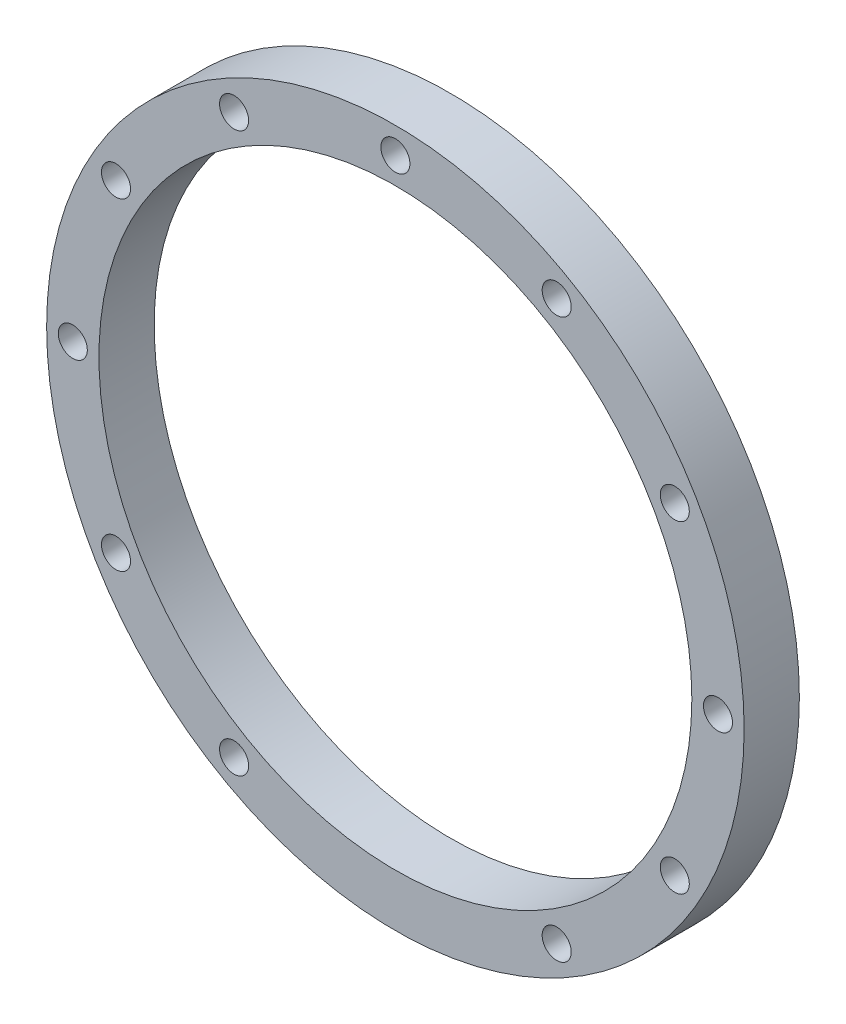
ISO-10303-21;
HEADER;
FILE_DESCRIPTION(('STEP AP214'),'2;1');
FILE_NAME('part.step','',(''),(''),'','','');
FILE_SCHEMA(('AUTOMOTIVE_DESIGN { 1 0 10303 214 1 1 1 1 }'));
ENDSEC;
DATA;
#1=APPLICATION_CONTEXT('core data for automotive mechanical design processes');
#2=APPLICATION_PROTOCOL_DEFINITION('international standard','automotive_design',2000,#1);
#3=PRODUCT_CONTEXT('',#1,'mechanical');
#4=PRODUCT('Part','Part','',(#3));
#5=PRODUCT_RELATED_PRODUCT_CATEGORY('part','',(#4));
#6=PRODUCT_DEFINITION_FORMATION('','',#4);
#7=PRODUCT_DEFINITION_CONTEXT('part definition',#1,'design');
#8=PRODUCT_DEFINITION('design','',#6,#7);
#9=PRODUCT_DEFINITION_SHAPE('','',#8);
#10=(LENGTH_UNIT() NAMED_UNIT(*) SI_UNIT(.MILLI.,.METRE.));
#11=(NAMED_UNIT(*) PLANE_ANGLE_UNIT() SI_UNIT($,.RADIAN.));
#12=(NAMED_UNIT(*) SI_UNIT($,.STERADIAN.) SOLID_ANGLE_UNIT());
#13=UNCERTAINTY_MEASURE_WITH_UNIT(LENGTH_MEASURE(1.E-05),#10,'distance_accuracy_value','');
#14=(GEOMETRIC_REPRESENTATION_CONTEXT(3) GLOBAL_UNCERTAINTY_ASSIGNED_CONTEXT((#13)) GLOBAL_UNIT_ASSIGNED_CONTEXT((#10,
#11,#12)) REPRESENTATION_CONTEXT('',''));
#15=CARTESIAN_POINT('',(0.,0.,0.));
#16=DIRECTION('',(0.,0.,1.));
#17=DIRECTION('',(1.,0.,0.));
#18=AXIS2_PLACEMENT_3D('',#15,#16,#17);
#19=CARTESIAN_POINT('',(0.,0.,9.5));
#20=DIRECTION('',(0.,0.,-1.));
#21=DIRECTION('',(-1.,0.,0.));
#22=AXIS2_PLACEMENT_3D('',#19,#20,#21);
#23=CYLINDRICAL_SURFACE('',#22,60.);
#24=CARTESIAN_POINT('',(0.,0.,9.5));
#25=DIRECTION('',(0.,0.,1.));
#26=DIRECTION('',(1.,0.,0.));
#27=AXIS2_PLACEMENT_3D('',#24,#25,#26);
#28=CIRCLE('',#27,60.);
#29=CARTESIAN_POINT('',(60.,0.,9.5));
#30=VERTEX_POINT('',#29);
#31=EDGE_CURVE('E10',#30,#30,#28,.T.);
#32=ORIENTED_EDGE('',*,*,#31,.F.);
#33=EDGE_LOOP('',(#32));
#34=FACE_BOUND('',#33,.T.);
#35=CARTESIAN_POINT('',(0.,0.,0.));
#36=DIRECTION('',(0.,0.,1.));
#37=DIRECTION('',(1.,0.,0.));
#38=AXIS2_PLACEMENT_3D('',#35,#36,#37);
#39=CIRCLE('',#38,60.);
#40=CARTESIAN_POINT('',(60.,0.,0.));
#41=VERTEX_POINT('',#40);
#42=EDGE_CURVE('E38',#41,#41,#39,.T.);
#43=ORIENTED_EDGE('',*,*,#42,.T.);
#44=EDGE_LOOP('',(#43));
#45=FACE_BOUND('',#44,.T.);
#46=ADVANCED_FACE('F35',(#34,#45),#23,.T.);
#47=CARTESIAN_POINT('',(0.,0.,9.5));
#48=DIRECTION('',(0.,0.,1.));
#49=DIRECTION('',(1.,0.,0.));
#50=AXIS2_PLACEMENT_3D('',#47,#48,#49);
#51=PLANE('',#50);
#52=CARTESIAN_POINT('',(0.,55.5,9.5));
#53=DIRECTION('',(0.,0.,1.));
#54=DIRECTION('',(1.,0.,0.));
#55=AXIS2_PLACEMENT_3D('',#52,#53,#54);
#56=CIRCLE('',#55,2.5);
#57=CARTESIAN_POINT('',(2.5,55.5,9.5));
#58=VERTEX_POINT('',#57);
#59=EDGE_CURVE('E96',#58,#58,#56,.T.);
#60=ORIENTED_EDGE('',*,*,#59,.F.);
#61=EDGE_LOOP('',(#60));
#62=FACE_BOUND('',#61,.T.);
#63=CARTESIAN_POINT('',(27.7500000000001,48.0644099100363,9.5));
#64=DIRECTION('',(0.,0.,1.));
#65=DIRECTION('',(1.,0.,0.));
#66=AXIS2_PLACEMENT_3D('',#63,#64,#65);
#67=CIRCLE('',#66,2.5);
#68=CARTESIAN_POINT('',(30.2500000000001,48.0644099100363,9.5));
#69=VERTEX_POINT('',#68);
#70=EDGE_CURVE('E90',#69,#69,#67,.T.);
#71=ORIENTED_EDGE('',*,*,#70,.F.);
#72=EDGE_LOOP('',(#71));
#73=FACE_BOUND('',#72,.T.);
#74=CARTESIAN_POINT('',(48.0644099100375,27.750000000002,9.5));
#75=DIRECTION('',(0.,0.,1.));
#76=DIRECTION('',(1.,0.,0.));
#77=AXIS2_PLACEMENT_3D('',#74,#75,#76);
#78=CIRCLE('',#77,2.50000000000066);
#79=CARTESIAN_POINT('',(50.5644099100382,27.750000000002,9.5));
#80=VERTEX_POINT('',#79);
#81=EDGE_CURVE('E84',#80,#80,#78,.T.);
#82=ORIENTED_EDGE('',*,*,#81,.F.);
#83=EDGE_LOOP('',(#82));
#84=FACE_BOUND('',#83,.T.);
#85=CARTESIAN_POINT('',(55.5000000000024,2.35591212547823E-12,9.5));
#86=DIRECTION('',(0.,0.,1.));
#87=DIRECTION('',(1.,0.,0.));
#88=AXIS2_PLACEMENT_3D('',#85,#86,#87);
#89=CIRCLE('',#88,2.50000000000175);
#90=CARTESIAN_POINT('',(58.0000000000041,2.35591212547823E-12,9.5));
#91=VERTEX_POINT('',#90);
#92=EDGE_CURVE('E78',#91,#91,#89,.T.);
#93=ORIENTED_EDGE('',*,*,#92,.F.);
#94=EDGE_LOOP('',(#93));
#95=FACE_BOUND('',#94,.T.);
#96=CARTESIAN_POINT('',(48.0644099100399,-27.749999999998,9.5));
#97=DIRECTION('',(0.,0.,1.));
#98=DIRECTION('',(1.,0.,0.));
#99=AXIS2_PLACEMENT_3D('',#96,#97,#98);
#100=CIRCLE('',#99,2.50000000000305);
#101=CARTESIAN_POINT('',(50.5644099100429,-27.749999999998,9.5));
#102=VERTEX_POINT('',#101);
#103=EDGE_CURVE('E72',#102,#102,#100,.T.);
#104=ORIENTED_EDGE('',*,*,#103,.F.);
#105=EDGE_LOOP('',(#104));
#106=FACE_BOUND('',#105,.T.);
#107=CARTESIAN_POINT('',(27.7500000000044,-48.0644099100352,9.5));
#108=DIRECTION('',(0.,0.,1.));
#109=DIRECTION('',(1.,0.,0.));
#110=AXIS2_PLACEMENT_3D('',#107,#108,#109);
#111=CIRCLE('',#110,2.50000000000419);
#112=CARTESIAN_POINT('',(30.2500000000086,-48.0644099100352,9.5));
#113=VERTEX_POINT('',#112);
#114=EDGE_CURVE('E66',#113,#113,#111,.T.);
#115=ORIENTED_EDGE('',*,*,#114,.F.);
#116=EDGE_LOOP('',(#115));
#117=FACE_BOUND('',#116,.T.);
#118=CARTESIAN_POINT('',(-27.7499999999956,-48.0644099100375,9.5));
#119=DIRECTION('',(0.,0.,1.));
#120=DIRECTION('',(1.,0.,0.));
#121=AXIS2_PLACEMENT_3D('',#118,#119,#120);
#122=CIRCLE('',#121,2.500000000005);
#123=CARTESIAN_POINT('',(-25.2499999999906,-48.0644099100375,9.5));
#124=VERTEX_POINT('',#123);
#125=EDGE_CURVE('E60',#124,#124,#122,.T.);
#126=ORIENTED_EDGE('',*,*,#125,.F.);
#127=EDGE_LOOP('',(#126));
#128=FACE_BOUND('',#127,.T.);
#129=CARTESIAN_POINT('',(-48.0644099100328,-27.7500000000021,9.5));
#130=DIRECTION('',(0.,0.,1.));
#131=DIRECTION('',(1.,0.,0.));
#132=AXIS2_PLACEMENT_3D('',#129,#130,#131);
#133=CIRCLE('',#132,2.50000000000449);
#134=CARTESIAN_POINT('',(-45.5644099100283,-27.7500000000021,9.5));
#135=VERTEX_POINT('',#134);
#136=EDGE_CURVE('E53',#135,#135,#133,.T.);
#137=ORIENTED_EDGE('',*,*,#136,.F.);
#138=EDGE_LOOP('',(#137));
#139=FACE_BOUND('',#138,.T.);
#140=CARTESIAN_POINT('',(-55.4999999999976,-2.3627089152135E-12,9.5));
#141=DIRECTION('',(0.,0.,1.));
#142=DIRECTION('',(1.,0.,0.));
#143=AXIS2_PLACEMENT_3D('',#140,#141,#142);
#144=CIRCLE('',#143,2.5000000000035);
#145=CARTESIAN_POINT('',(-52.9999999999941,-2.3627089152135E-12,9.5));
#146=VERTEX_POINT('',#145);
#147=EDGE_CURVE('E113',#146,#146,#144,.T.);
#148=ORIENTED_EDGE('',*,*,#147,.F.);
#149=EDGE_LOOP('',(#148));
#150=FACE_BOUND('',#149,.T.);
#151=CARTESIAN_POINT('',(-48.0644099100352,27.7499999999979,9.5));
#152=DIRECTION('',(0.,0.,1.));
#153=DIRECTION('',(1.,0.,0.));
#154=AXIS2_PLACEMENT_3D('',#151,#152,#153);
#155=CIRCLE('',#154,2.50000000000238);
#156=CARTESIAN_POINT('',(-45.5644099100328,27.7499999999979,9.5));
#157=VERTEX_POINT('',#156);
#158=EDGE_CURVE('E107',#157,#157,#155,.T.);
#159=ORIENTED_EDGE('',*,*,#158,.F.);
#160=EDGE_LOOP('',(#159));
#161=FACE_BOUND('',#160,.T.);
#162=CARTESIAN_POINT('',(-27.7499999999997,48.0644099100352,9.5));
#163=DIRECTION('',(0.,0.,1.));
#164=DIRECTION('',(1.,0.,0.));
#165=AXIS2_PLACEMENT_3D('',#162,#163,#164);
#166=CIRCLE('',#165,2.50000000000136);
#167=CARTESIAN_POINT('',(-25.2499999999984,48.0644099100352,9.5));
#168=VERTEX_POINT('',#167);
#169=EDGE_CURVE('E101',#168,#168,#166,.T.);
#170=ORIENTED_EDGE('',*,*,#169,.F.);
#171=EDGE_LOOP('',(#170));
#172=FACE_BOUND('',#171,.T.);
#173=CARTESIAN_POINT('',(0.,0.,9.5));
#174=DIRECTION('',(0.,0.,1.));
#175=DIRECTION('',(1.,0.,0.));
#176=AXIS2_PLACEMENT_3D('',#173,#174,#175);
#177=CIRCLE('',#176,51.);
#178=CARTESIAN_POINT('',(51.,0.,9.5));
#179=VERTEX_POINT('',#178);
#180=EDGE_CURVE('E47',#179,#179,#177,.T.);
#181=ORIENTED_EDGE('',*,*,#180,.F.);
#182=EDGE_LOOP('',(#181));
#183=FACE_BOUND('',#182,.T.);
#184=ORIENTED_EDGE('',*,*,#31,.T.);
#185=EDGE_LOOP('',(#184));
#186=FACE_BOUND('',#185,.T.);
#187=ADVANCED_FACE('F130',(#62,#73,#84,#95,#106,#117,#128,#139,#150,#161,#172,#183,#186),#51,.T.);
#188=CARTESIAN_POINT('',(0.,0.,0.));
#189=DIRECTION('',(0.,0.,1.));
#190=DIRECTION('',(1.,0.,0.));
#191=AXIS2_PLACEMENT_3D('',#188,#189,#190);
#192=PLANE('',#191);
#193=CARTESIAN_POINT('',(0.,55.5,0.));
#194=DIRECTION('',(0.,0.,1.));
#195=DIRECTION('',(1.,0.,0.));
#196=AXIS2_PLACEMENT_3D('',#193,#194,#195);
#197=CIRCLE('',#196,2.5);
#198=CARTESIAN_POINT('',(2.5,55.5,0.));
#199=VERTEX_POINT('',#198);
#200=EDGE_CURVE('E50',#199,#199,#197,.T.);
#201=ORIENTED_EDGE('',*,*,#200,.T.);
#202=EDGE_LOOP('',(#201));
#203=FACE_BOUND('',#202,.T.);
#204=CARTESIAN_POINT('',(27.7500000000001,48.0644099100363,0.));
#205=DIRECTION('',(0.,0.,1.));
#206=DIRECTION('',(1.,0.,0.));
#207=AXIS2_PLACEMENT_3D('',#204,#205,#206);
#208=CIRCLE('',#207,2.5);
#209=CARTESIAN_POINT('',(30.2500000000001,48.0644099100363,0.));
#210=VERTEX_POINT('',#209);
#211=EDGE_CURVE('E93',#210,#210,#208,.T.);
#212=ORIENTED_EDGE('',*,*,#211,.T.);
#213=EDGE_LOOP('',(#212));
#214=FACE_BOUND('',#213,.T.);
#215=CARTESIAN_POINT('',(48.0644099100375,27.750000000002,0.));
#216=DIRECTION('',(0.,0.,1.));
#217=DIRECTION('',(1.,0.,0.));
#218=AXIS2_PLACEMENT_3D('',#215,#216,#217);
#219=CIRCLE('',#218,2.50000000000066);
#220=CARTESIAN_POINT('',(50.5644099100382,27.750000000002,0.));
#221=VERTEX_POINT('',#220);
#222=EDGE_CURVE('E87',#221,#221,#219,.T.);
#223=ORIENTED_EDGE('',*,*,#222,.T.);
#224=EDGE_LOOP('',(#223));
#225=FACE_BOUND('',#224,.T.);
#226=CARTESIAN_POINT('',(55.5000000000024,2.35591212547823E-12,0.));
#227=DIRECTION('',(0.,0.,1.));
#228=DIRECTION('',(1.,0.,0.));
#229=AXIS2_PLACEMENT_3D('',#226,#227,#228);
#230=CIRCLE('',#229,2.50000000000175);
#231=CARTESIAN_POINT('',(58.0000000000041,2.35591212547823E-12,0.));
#232=VERTEX_POINT('',#231);
#233=EDGE_CURVE('E81',#232,#232,#230,.T.);
#234=ORIENTED_EDGE('',*,*,#233,.T.);
#235=EDGE_LOOP('',(#234));
#236=FACE_BOUND('',#235,.T.);
#237=CARTESIAN_POINT('',(48.0644099100399,-27.749999999998,0.));
#238=DIRECTION('',(0.,0.,1.));
#239=DIRECTION('',(1.,0.,0.));
#240=AXIS2_PLACEMENT_3D('',#237,#238,#239);
#241=CIRCLE('',#240,2.50000000000305);
#242=CARTESIAN_POINT('',(50.5644099100429,-27.749999999998,0.));
#243=VERTEX_POINT('',#242);
#244=EDGE_CURVE('E75',#243,#243,#241,.T.);
#245=ORIENTED_EDGE('',*,*,#244,.T.);
#246=EDGE_LOOP('',(#245));
#247=FACE_BOUND('',#246,.T.);
#248=CARTESIAN_POINT('',(27.7500000000044,-48.0644099100352,0.));
#249=DIRECTION('',(0.,0.,1.));
#250=DIRECTION('',(1.,0.,0.));
#251=AXIS2_PLACEMENT_3D('',#248,#249,#250);
#252=CIRCLE('',#251,2.50000000000419);
#253=CARTESIAN_POINT('',(30.2500000000086,-48.0644099100352,0.));
#254=VERTEX_POINT('',#253);
#255=EDGE_CURVE('E69',#254,#254,#252,.T.);
#256=ORIENTED_EDGE('',*,*,#255,.T.);
#257=EDGE_LOOP('',(#256));
#258=FACE_BOUND('',#257,.T.);
#259=CARTESIAN_POINT('',(-27.7499999999956,-48.0644099100375,0.));
#260=DIRECTION('',(0.,0.,1.));
#261=DIRECTION('',(1.,0.,0.));
#262=AXIS2_PLACEMENT_3D('',#259,#260,#261);
#263=CIRCLE('',#262,2.500000000005);
#264=CARTESIAN_POINT('',(-25.2499999999906,-48.0644099100375,0.));
#265=VERTEX_POINT('',#264);
#266=EDGE_CURVE('E63',#265,#265,#263,.T.);
#267=ORIENTED_EDGE('',*,*,#266,.T.);
#268=EDGE_LOOP('',(#267));
#269=FACE_BOUND('',#268,.T.);
#270=CARTESIAN_POINT('',(-48.0644099100328,-27.7500000000021,0.));
#271=DIRECTION('',(0.,0.,1.));
#272=DIRECTION('',(1.,0.,0.));
#273=AXIS2_PLACEMENT_3D('',#270,#271,#272);
#274=CIRCLE('',#273,2.50000000000449);
#275=CARTESIAN_POINT('',(-45.5644099100283,-27.7500000000021,0.));
#276=VERTEX_POINT('',#275);
#277=EDGE_CURVE('E56',#276,#276,#274,.T.);
#278=ORIENTED_EDGE('',*,*,#277,.T.);
#279=EDGE_LOOP('',(#278));
#280=FACE_BOUND('',#279,.T.);
#281=CARTESIAN_POINT('',(-55.4999999999976,-2.3627089152135E-12,0.));
#282=DIRECTION('',(0.,0.,1.));
#283=DIRECTION('',(1.,0.,0.));
#284=AXIS2_PLACEMENT_3D('',#281,#282,#283);
#285=CIRCLE('',#284,2.5000000000035);
#286=CARTESIAN_POINT('',(-52.9999999999941,-2.3627089152135E-12,0.));
#287=VERTEX_POINT('',#286);
#288=EDGE_CURVE('E57',#287,#287,#285,.T.);
#289=ORIENTED_EDGE('',*,*,#288,.T.);
#290=EDGE_LOOP('',(#289));
#291=FACE_BOUND('',#290,.T.);
#292=CARTESIAN_POINT('',(-48.0644099100352,27.7499999999979,0.));
#293=DIRECTION('',(0.,0.,1.));
#294=DIRECTION('',(1.,0.,0.));
#295=AXIS2_PLACEMENT_3D('',#292,#293,#294);
#296=CIRCLE('',#295,2.50000000000238);
#297=CARTESIAN_POINT('',(-45.5644099100328,27.7499999999979,0.));
#298=VERTEX_POINT('',#297);
#299=EDGE_CURVE('E110',#298,#298,#296,.T.);
#300=ORIENTED_EDGE('',*,*,#299,.T.);
#301=EDGE_LOOP('',(#300));
#302=FACE_BOUND('',#301,.T.);
#303=CARTESIAN_POINT('',(-27.7499999999997,48.0644099100352,0.));
#304=DIRECTION('',(0.,0.,1.));
#305=DIRECTION('',(1.,0.,0.));
#306=AXIS2_PLACEMENT_3D('',#303,#304,#305);
#307=CIRCLE('',#306,2.50000000000136);
#308=CARTESIAN_POINT('',(-25.2499999999984,48.0644099100352,0.));
#309=VERTEX_POINT('',#308);
#310=EDGE_CURVE('E104',#309,#309,#307,.T.);
#311=ORIENTED_EDGE('',*,*,#310,.T.);
#312=EDGE_LOOP('',(#311));
#313=FACE_BOUND('',#312,.T.);
#314=CARTESIAN_POINT('',(0.,0.,0.));
#315=DIRECTION('',(0.,0.,1.));
#316=DIRECTION('',(1.,0.,0.));
#317=AXIS2_PLACEMENT_3D('',#314,#315,#316);
#318=CIRCLE('',#317,51.);
#319=CARTESIAN_POINT('',(51.,0.,0.));
#320=VERTEX_POINT('',#319);
#321=EDGE_CURVE('E45',#320,#320,#318,.T.);
#322=ORIENTED_EDGE('',*,*,#321,.T.);
#323=EDGE_LOOP('',(#322));
#324=FACE_BOUND('',#323,.T.);
#325=ORIENTED_EDGE('',*,*,#42,.F.);
#326=EDGE_LOOP('',(#325));
#327=FACE_BOUND('',#326,.T.);
#328=ADVANCED_FACE('F119',(#203,#214,#225,#236,#247,#258,#269,#280,#291,#302,#313,#324,#327),
#192,.F.);
#329=CARTESIAN_POINT('',(0.,0.,0.));
#330=DIRECTION('',(0.,0.,1.));
#331=DIRECTION('',(1.,0.,0.));
#332=AXIS2_PLACEMENT_3D('',#329,#330,#331);
#333=CYLINDRICAL_SURFACE('',#332,51.);
#334=ORIENTED_EDGE('',*,*,#321,.F.);
#335=EDGE_LOOP('',(#334));
#336=FACE_BOUND('',#335,.T.);
#337=ORIENTED_EDGE('',*,*,#180,.T.);
#338=EDGE_LOOP('',(#337));
#339=FACE_BOUND('',#338,.T.);
#340=ADVANCED_FACE('F141',(#336,#339),#333,.F.);
#341=CARTESIAN_POINT('',(-27.7499999999997,48.0644099100352,0.));
#342=DIRECTION('',(0.,0.,1.));
#343=DIRECTION('',(1.,0.,0.));
#344=AXIS2_PLACEMENT_3D('',#341,#342,#343);
#345=CYLINDRICAL_SURFACE('',#344,2.50000000000136);
#346=ORIENTED_EDGE('',*,*,#310,.F.);
#347=EDGE_LOOP('',(#346));
#348=FACE_BOUND('',#347,.T.);
#349=ORIENTED_EDGE('',*,*,#169,.T.);
#350=EDGE_LOOP('',(#349));
#351=FACE_BOUND('',#350,.T.);
#352=ADVANCED_FACE('F143',(#348,#351),#345,.F.);
#353=CARTESIAN_POINT('',(-48.0644099100352,27.7499999999979,0.));
#354=DIRECTION('',(0.,0.,1.));
#355=DIRECTION('',(1.,0.,0.));
#356=AXIS2_PLACEMENT_3D('',#353,#354,#355);
#357=CYLINDRICAL_SURFACE('',#356,2.50000000000238);
#358=ORIENTED_EDGE('',*,*,#299,.F.);
#359=EDGE_LOOP('',(#358));
#360=FACE_BOUND('',#359,.T.);
#361=ORIENTED_EDGE('',*,*,#158,.T.);
#362=EDGE_LOOP('',(#361));
#363=FACE_BOUND('',#362,.T.);
#364=ADVANCED_FACE('F126',(#360,#363),#357,.F.);
#365=CARTESIAN_POINT('',(-55.4999999999976,-2.3627089152135E-12,0.));
#366=DIRECTION('',(0.,0.,1.));
#367=DIRECTION('',(1.,0.,0.));
#368=AXIS2_PLACEMENT_3D('',#365,#366,#367);
#369=CYLINDRICAL_SURFACE('',#368,2.5000000000035);
#370=ORIENTED_EDGE('',*,*,#288,.F.);
#371=EDGE_LOOP('',(#370));
#372=FACE_BOUND('',#371,.T.);
#373=ORIENTED_EDGE('',*,*,#147,.T.);
#374=EDGE_LOOP('',(#373));
#375=FACE_BOUND('',#374,.T.);
#376=ADVANCED_FACE('F122',(#372,#375),#369,.F.);
#377=CARTESIAN_POINT('',(-48.0644099100328,-27.7500000000021,0.));
#378=DIRECTION('',(0.,0.,1.));
#379=DIRECTION('',(1.,0.,0.));
#380=AXIS2_PLACEMENT_3D('',#377,#378,#379);
#381=CYLINDRICAL_SURFACE('',#380,2.50000000000449);
#382=ORIENTED_EDGE('',*,*,#277,.F.);
#383=EDGE_LOOP('',(#382));
#384=FACE_BOUND('',#383,.T.);
#385=ORIENTED_EDGE('',*,*,#136,.T.);
#386=EDGE_LOOP('',(#385));
#387=FACE_BOUND('',#386,.T.);
#388=ADVANCED_FACE('F125',(#384,#387),#381,.F.);
#389=CARTESIAN_POINT('',(-27.7499999999956,-48.0644099100375,0.));
#390=DIRECTION('',(0.,0.,1.));
#391=DIRECTION('',(1.,0.,0.));
#392=AXIS2_PLACEMENT_3D('',#389,#390,#391);
#393=CYLINDRICAL_SURFACE('',#392,2.500000000005);
#394=ORIENTED_EDGE('',*,*,#266,.F.);
#395=EDGE_LOOP('',(#394));
#396=FACE_BOUND('',#395,.T.);
#397=ORIENTED_EDGE('',*,*,#125,.T.);
#398=EDGE_LOOP('',(#397));
#399=FACE_BOUND('',#398,.T.);
#400=ADVANCED_FACE('F204',(#396,#399),#393,.F.);
#401=CARTESIAN_POINT('',(27.7500000000044,-48.0644099100352,0.));
#402=DIRECTION('',(0.,0.,1.));
#403=DIRECTION('',(1.,0.,0.));
#404=AXIS2_PLACEMENT_3D('',#401,#402,#403);
#405=CYLINDRICAL_SURFACE('',#404,2.50000000000419);
#406=ORIENTED_EDGE('',*,*,#255,.F.);
#407=EDGE_LOOP('',(#406));
#408=FACE_BOUND('',#407,.T.);
#409=ORIENTED_EDGE('',*,*,#114,.T.);
#410=EDGE_LOOP('',(#409));
#411=FACE_BOUND('',#410,.T.);
#412=ADVANCED_FACE('F213',(#408,#411),#405,.F.);
#413=CARTESIAN_POINT('',(48.0644099100399,-27.749999999998,0.));
#414=DIRECTION('',(0.,0.,1.));
#415=DIRECTION('',(1.,0.,0.));
#416=AXIS2_PLACEMENT_3D('',#413,#414,#415);
#417=CYLINDRICAL_SURFACE('',#416,2.50000000000305);
#418=ORIENTED_EDGE('',*,*,#244,.F.);
#419=EDGE_LOOP('',(#418));
#420=FACE_BOUND('',#419,.T.);
#421=ORIENTED_EDGE('',*,*,#103,.T.);
#422=EDGE_LOOP('',(#421));
#423=FACE_BOUND('',#422,.T.);
#424=ADVANCED_FACE('F223',(#420,#423),#417,.F.);
#425=CARTESIAN_POINT('',(55.5000000000024,2.35591212547823E-12,0.));
#426=DIRECTION('',(0.,0.,1.));
#427=DIRECTION('',(1.,0.,0.));
#428=AXIS2_PLACEMENT_3D('',#425,#426,#427);
#429=CYLINDRICAL_SURFACE('',#428,2.50000000000175);
#430=ORIENTED_EDGE('',*,*,#233,.F.);
#431=EDGE_LOOP('',(#430));
#432=FACE_BOUND('',#431,.T.);
#433=ORIENTED_EDGE('',*,*,#92,.T.);
#434=EDGE_LOOP('',(#433));
#435=FACE_BOUND('',#434,.T.);
#436=ADVANCED_FACE('F233',(#432,#435),#429,.F.);
#437=CARTESIAN_POINT('',(48.0644099100375,27.750000000002,0.));
#438=DIRECTION('',(0.,0.,1.));
#439=DIRECTION('',(1.,0.,0.));
#440=AXIS2_PLACEMENT_3D('',#437,#438,#439);
#441=CYLINDRICAL_SURFACE('',#440,2.50000000000066);
#442=ORIENTED_EDGE('',*,*,#222,.F.);
#443=EDGE_LOOP('',(#442));
#444=FACE_BOUND('',#443,.T.);
#445=ORIENTED_EDGE('',*,*,#81,.T.);
#446=EDGE_LOOP('',(#445));
#447=FACE_BOUND('',#446,.T.);
#448=ADVANCED_FACE('F243',(#444,#447),#441,.F.);
#449=CARTESIAN_POINT('',(27.7500000000001,48.0644099100363,0.));
#450=DIRECTION('',(0.,0.,1.));
#451=DIRECTION('',(1.,0.,0.));
#452=AXIS2_PLACEMENT_3D('',#449,#450,#451);
#453=CYLINDRICAL_SURFACE('',#452,2.5);
#454=ORIENTED_EDGE('',*,*,#211,.F.);
#455=EDGE_LOOP('',(#454));
#456=FACE_BOUND('',#455,.T.);
#457=ORIENTED_EDGE('',*,*,#70,.T.);
#458=EDGE_LOOP('',(#457));
#459=FACE_BOUND('',#458,.T.);
#460=ADVANCED_FACE('F253',(#456,#459),#453,.F.);
#461=CARTESIAN_POINT('',(0.,55.5,0.));
#462=DIRECTION('',(0.,0.,1.));
#463=DIRECTION('',(1.,0.,0.));
#464=AXIS2_PLACEMENT_3D('',#461,#462,#463);
#465=CYLINDRICAL_SURFACE('',#464,2.5);
#466=ORIENTED_EDGE('',*,*,#200,.F.);
#467=EDGE_LOOP('',(#466));
#468=FACE_BOUND('',#467,.T.);
#469=ORIENTED_EDGE('',*,*,#59,.T.);
#470=EDGE_LOOP('',(#469));
#471=FACE_BOUND('',#470,.T.);
#472=ADVANCED_FACE('F263',(#468,#471),#465,.F.);
#473=CLOSED_SHELL('',(#46,#187,#328,#340,#352,#364,#376,#388,#400,#412,#424,#436,#448,#460,#472));
#474=MANIFOLD_SOLID_BREP('B2',#473);
#475=ADVANCED_BREP_SHAPE_REPRESENTATION('',(#18,#474),#14);
#476=SHAPE_DEFINITION_REPRESENTATION(#9,#475);
ENDSEC;
END-ISO-10303-21;
